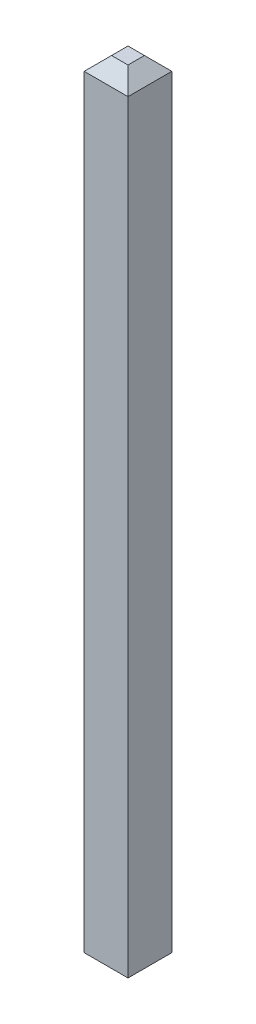
ISO-10303-21;
HEADER;
FILE_DESCRIPTION(('STEP AP214'),'2;1');
FILE_NAME('part.step','',(''),(''),'','','');
FILE_SCHEMA(('AUTOMOTIVE_DESIGN { 1 0 10303 214 1 1 1 1 }'));
ENDSEC;
DATA;
#1=APPLICATION_CONTEXT('core data for automotive mechanical design processes');
#2=APPLICATION_PROTOCOL_DEFINITION('international standard','automotive_design',2000,#1);
#3=PRODUCT_CONTEXT('',#1,'mechanical');
#4=PRODUCT('Part','Part','',(#3));
#5=PRODUCT_RELATED_PRODUCT_CATEGORY('part','',(#4));
#6=PRODUCT_DEFINITION_FORMATION('','',#4);
#7=PRODUCT_DEFINITION_CONTEXT('part definition',#1,'design');
#8=PRODUCT_DEFINITION('design','',#6,#7);
#9=PRODUCT_DEFINITION_SHAPE('','',#8);
#10=(LENGTH_UNIT() NAMED_UNIT(*) SI_UNIT(.MILLI.,.METRE.));
#11=(NAMED_UNIT(*) PLANE_ANGLE_UNIT() SI_UNIT($,.RADIAN.));
#12=(NAMED_UNIT(*) SI_UNIT($,.STERADIAN.) SOLID_ANGLE_UNIT());
#13=UNCERTAINTY_MEASURE_WITH_UNIT(LENGTH_MEASURE(1.E-05),#10,'distance_accuracy_value','');
#14=(GEOMETRIC_REPRESENTATION_CONTEXT(3) GLOBAL_UNCERTAINTY_ASSIGNED_CONTEXT((#13)) GLOBAL_UNIT_ASSIGNED_CONTEXT((#10,
#11,#12)) REPRESENTATION_CONTEXT('',''));
#15=CARTESIAN_POINT('',(0.,0.,0.));
#16=DIRECTION('',(0.,0.,1.));
#17=DIRECTION('',(1.,0.,0.));
#18=AXIS2_PLACEMENT_3D('',#15,#16,#17);
#19=CARTESIAN_POINT('',(6.67,7.07,-0.32));
#20=DIRECTION('',(-0.707106781186548,-0.707106781186548,0.));
#21=DIRECTION('',(-0.707106781186548,0.707106781186548,0.));
#22=AXIS2_PLACEMENT_3D('',#19,#20,#21);
#23=PLANE('',#22);
#24=DIRECTION('',(0.577350269189626,-0.577350269189626,0.577350269189626));
#25=VECTOR('',#24,1.);
#26=CARTESIAN_POINT('',(6.456666666667,7.283333333333,0.106666666667));
#27=LINE('',#26,#25);
#28=CARTESIAN_POINT('',(6.47,7.27,0.12));
#29=VERTEX_POINT('',#28);
#30=CARTESIAN_POINT('',(6.67,7.07,0.32));
#31=VERTEX_POINT('',#30);
#32=EDGE_CURVE('E112',#29,#31,#27,.T.);
#33=ORIENTED_EDGE('',*,*,#32,.T.);
#34=DIRECTION('',(0.,0.,1.));
#35=VECTOR('',#34,1.);
#36=CARTESIAN_POINT('',(6.67,7.07,-0.32));
#37=LINE('',#36,#35);
#38=CARTESIAN_POINT('',(6.67,7.07,-0.32));
#39=VERTEX_POINT('',#38);
#40=EDGE_CURVE('E121',#39,#31,#37,.T.);
#41=ORIENTED_EDGE('',*,*,#40,.F.);
#42=DIRECTION('',(0.577350269189626,-0.577350269189626,-0.577350269189626));
#43=VECTOR('',#42,1.);
#44=CARTESIAN_POINT('',(6.67,7.07,-0.32));
#45=LINE('',#44,#43);
#46=CARTESIAN_POINT('',(6.47,7.27,-0.12));
#47=VERTEX_POINT('',#46);
#48=EDGE_CURVE('E11',#47,#39,#45,.T.);
#49=ORIENTED_EDGE('',*,*,#48,.F.);
#50=DIRECTION('',(0.,0.,-1.));
#51=VECTOR('',#50,1.);
#52=CARTESIAN_POINT('',(6.47,7.27,-0.32));
#53=LINE('',#52,#51);
#54=EDGE_CURVE('E163',#29,#47,#53,.T.);
#55=ORIENTED_EDGE('',*,*,#54,.F.);
#56=EDGE_LOOP('',(#33,#41,#49,#55));
#57=FACE_BOUND('',#56,.T.);
#58=ADVANCED_FACE('F17',(#57),#23,.F.);
#59=CARTESIAN_POINT('',(6.35,7.07,-0.32));
#60=DIRECTION('',(0.,0.707106781186548,-0.707106781186548));
#61=DIRECTION('',(-1.,0.,0.));
#62=AXIS2_PLACEMENT_3D('',#59,#60,#61);
#63=PLANE('',#62);
#64=DIRECTION('',(0.577350269189626,0.577350269189626,0.577350269189626));
#65=VECTOR('',#64,1.);
#66=CARTESIAN_POINT('',(6.163333333333,7.203333333333,-0.186666666667));
#67=LINE('',#66,#65);
#68=CARTESIAN_POINT('',(6.03,7.07,-0.32));
#69=VERTEX_POINT('',#68);
#70=CARTESIAN_POINT('',(6.23,7.27,-0.12));
#71=VERTEX_POINT('',#70);
#72=EDGE_CURVE('E26',#69,#71,#67,.T.);
#73=ORIENTED_EDGE('',*,*,#72,.T.);
#74=DIRECTION('',(-1.,0.,0.));
#75=VECTOR('',#74,1.);
#76=CARTESIAN_POINT('',(6.03,7.27,-0.12));
#77=LINE('',#76,#75);
#78=EDGE_CURVE('E164',#47,#71,#77,.T.);
#79=ORIENTED_EDGE('',*,*,#78,.F.);
#80=ORIENTED_EDGE('',*,*,#48,.T.);
#81=DIRECTION('',(1.,0.,0.));
#82=VECTOR('',#81,1.);
#83=CARTESIAN_POINT('',(6.67,7.07,-0.32));
#84=LINE('',#83,#82);
#85=EDGE_CURVE('E142',#69,#39,#84,.T.);
#86=ORIENTED_EDGE('',*,*,#85,.F.);
#87=EDGE_LOOP('',(#73,#79,#80,#86));
#88=FACE_BOUND('',#87,.T.);
#89=ADVANCED_FACE('F177',(#88),#63,.T.);
#90=CARTESIAN_POINT('',(6.23,7.27,-0.32));
#91=DIRECTION('',(0.707106781186548,-0.707106781186548,0.));
#92=DIRECTION('',(0.,0.,-1.));
#93=AXIS2_PLACEMENT_3D('',#90,#91,#92);
#94=PLANE('',#93);
#95=DIRECTION('',(-0.577350269189626,-0.577350269189626,0.577350269189626));
#96=VECTOR('',#95,1.);
#97=CARTESIAN_POINT('',(6.163333333333,7.203333333333,0.186666666667));
#98=LINE('',#97,#96);
#99=CARTESIAN_POINT('',(6.23,7.27,0.12));
#100=VERTEX_POINT('',#99);
#101=CARTESIAN_POINT('',(6.03,7.07,0.32));
#102=VERTEX_POINT('',#101);
#103=EDGE_CURVE('E39',#100,#102,#98,.T.);
#104=ORIENTED_EDGE('',*,*,#103,.F.);
#105=DIRECTION('',(0.,0.,1.));
#106=VECTOR('',#105,1.);
#107=CARTESIAN_POINT('',(6.23,7.27,-0.32));
#108=LINE('',#107,#106);
#109=EDGE_CURVE('E168',#71,#100,#108,.T.);
#110=ORIENTED_EDGE('',*,*,#109,.F.);
#111=ORIENTED_EDGE('',*,*,#72,.F.);
#112=DIRECTION('',(0.,0.,-1.));
#113=VECTOR('',#112,1.);
#114=CARTESIAN_POINT('',(6.03,7.07,-0.32));
#115=LINE('',#114,#113);
#116=EDGE_CURVE('E124',#102,#69,#115,.T.);
#117=ORIENTED_EDGE('',*,*,#116,.F.);
#118=EDGE_LOOP('',(#104,#110,#111,#117));
#119=FACE_BOUND('',#118,.T.);
#120=ADVANCED_FACE('F125',(#119),#94,.F.);
#121=CARTESIAN_POINT('',(6.03,7.27,0.12));
#122=DIRECTION('',(0.,-0.707106781186548,-0.707106781186548));
#123=DIRECTION('',(0.,-0.707106781186548,0.707106781186548));
#124=AXIS2_PLACEMENT_3D('',#121,#122,#123);
#125=PLANE('',#124);
#126=ORIENTED_EDGE('',*,*,#32,.F.);
#127=DIRECTION('',(1.,0.,0.));
#128=VECTOR('',#127,1.);
#129=CARTESIAN_POINT('',(6.03,7.27,0.12));
#130=LINE('',#129,#128);
#131=EDGE_CURVE('E109',#100,#29,#130,.T.);
#132=ORIENTED_EDGE('',*,*,#131,.F.);
#133=ORIENTED_EDGE('',*,*,#103,.T.);
#134=DIRECTION('',(-1.,0.,0.));
#135=VECTOR('',#134,1.);
#136=CARTESIAN_POINT('',(6.35,7.07,0.32));
#137=LINE('',#136,#135);
#138=EDGE_CURVE('E106',#31,#102,#137,.T.);
#139=ORIENTED_EDGE('',*,*,#138,.F.);
#140=EDGE_LOOP('',(#126,#132,#133,#139));
#141=FACE_BOUND('',#140,.T.);
#142=ADVANCED_FACE('F105',(#141),#125,.F.);
#143=CARTESIAN_POINT('',(6.03,7.27,-0.32));
#144=DIRECTION('',(0.,-1.,0.));
#145=DIRECTION('',(0.,0.,-1.));
#146=AXIS2_PLACEMENT_3D('',#143,#144,#145);
#147=PLANE('',#146);
#148=ORIENTED_EDGE('',*,*,#54,.T.);
#149=ORIENTED_EDGE('',*,*,#78,.T.);
#150=ORIENTED_EDGE('',*,*,#109,.T.);
#151=ORIENTED_EDGE('',*,*,#131,.T.);
#152=EDGE_LOOP('',(#148,#149,#150,#151));
#153=FACE_BOUND('',#152,.T.);
#154=ADVANCED_FACE('F182',(#153),#147,.F.);
#155=CARTESIAN_POINT('',(6.67,7.27,-0.32));
#156=DIRECTION('',(-1.,0.,0.));
#157=DIRECTION('',(0.,1.,0.));
#158=AXIS2_PLACEMENT_3D('',#155,#156,#157);
#159=PLANE('',#158);
#160=DIRECTION('',(0.,-1.,0.));
#161=VECTOR('',#160,1.);
#162=CARTESIAN_POINT('',(6.67,7.27,-0.32));
#163=LINE('',#162,#161);
#164=CARTESIAN_POINT('',(6.67,-4.07,-0.32));
#165=VERTEX_POINT('',#164);
#166=EDGE_CURVE('E135',#39,#165,#163,.T.);
#167=ORIENTED_EDGE('',*,*,#166,.F.);
#168=ORIENTED_EDGE('',*,*,#40,.T.);
#169=DIRECTION('',(0.,-1.,0.));
#170=VECTOR('',#169,1.);
#171=CARTESIAN_POINT('',(6.67,7.27,0.32));
#172=LINE('',#171,#170);
#173=CARTESIAN_POINT('',(6.67,-4.07,0.32));
#174=VERTEX_POINT('',#173);
#175=EDGE_CURVE('E119',#31,#174,#172,.T.);
#176=ORIENTED_EDGE('',*,*,#175,.T.);
#177=DIRECTION('',(0.,0.,-1.));
#178=VECTOR('',#177,1.);
#179=CARTESIAN_POINT('',(6.67,-4.07,-0.32));
#180=LINE('',#179,#178);
#181=EDGE_CURVE('E157',#174,#165,#180,.T.);
#182=ORIENTED_EDGE('',*,*,#181,.T.);
#183=EDGE_LOOP('',(#167,#168,#176,#182));
#184=FACE_BOUND('',#183,.T.);
#185=ADVANCED_FACE('F310',(#184),#159,.F.);
#186=CARTESIAN_POINT('',(6.35,1.5,0.32));
#187=DIRECTION('',(0.,0.,-1.));
#188=DIRECTION('',(0.,-1.,0.));
#189=AXIS2_PLACEMENT_3D('',#186,#187,#188);
#190=PLANE('',#189);
#191=ORIENTED_EDGE('',*,*,#175,.F.);
#192=ORIENTED_EDGE('',*,*,#138,.T.);
#193=DIRECTION('',(0.,1.,0.));
#194=VECTOR('',#193,1.);
#195=CARTESIAN_POINT('',(6.03,-4.27,0.32));
#196=LINE('',#195,#194);
#197=CARTESIAN_POINT('',(6.03,-4.07,0.32));
#198=VERTEX_POINT('',#197);
#199=EDGE_CURVE('E118',#198,#102,#196,.T.);
#200=ORIENTED_EDGE('',*,*,#199,.F.);
#201=DIRECTION('',(1.,0.,0.));
#202=VECTOR('',#201,1.);
#203=CARTESIAN_POINT('',(6.35,-4.07,0.32));
#204=LINE('',#203,#202);
#205=EDGE_CURVE('E98',#198,#174,#204,.T.);
#206=ORIENTED_EDGE('',*,*,#205,.T.);
#207=EDGE_LOOP('',(#191,#192,#200,#206));
#208=FACE_BOUND('',#207,.T.);
#209=ADVANCED_FACE('F116',(#208),#190,.F.);
#210=CARTESIAN_POINT('',(6.47,-4.27,-0.32));
#211=DIRECTION('',(-0.707106781186548,0.707106781186548,0.));
#212=DIRECTION('',(0.,0.,1.));
#213=AXIS2_PLACEMENT_3D('',#210,#211,#212);
#214=PLANE('',#213);
#215=DIRECTION('',(-0.577350269189626,-0.577350269189626,0.577350269189626));
#216=VECTOR('',#215,1.);
#217=CARTESIAN_POINT('',(6.536666666667,-4.203333333333,-0.186666666667));
#218=LINE('',#217,#216);
#219=CARTESIAN_POINT('',(6.47,-4.27,-0.12));
#220=VERTEX_POINT('',#219);
#221=EDGE_CURVE('E148',#165,#220,#218,.T.);
#222=ORIENTED_EDGE('',*,*,#221,.F.);
#223=ORIENTED_EDGE('',*,*,#181,.F.);
#224=DIRECTION('',(-0.577350269189626,-0.577350269189626,-0.577350269189626));
#225=VECTOR('',#224,1.);
#226=CARTESIAN_POINT('',(6.323333333333,-4.416666666667,-0.02666666666667));
#227=LINE('',#226,#225);
#228=CARTESIAN_POINT('',(6.47,-4.27,0.12));
#229=VERTEX_POINT('',#228);
#230=EDGE_CURVE('E156',#174,#229,#227,.T.);
#231=ORIENTED_EDGE('',*,*,#230,.T.);
#232=DIRECTION('',(0.,0.,1.));
#233=VECTOR('',#232,1.);
#234=CARTESIAN_POINT('',(6.47,-4.27,-0.32));
#235=LINE('',#234,#233);
#236=EDGE_CURVE('E551',#220,#229,#235,.T.);
#237=ORIENTED_EDGE('',*,*,#236,.F.);
#238=EDGE_LOOP('',(#222,#223,#231,#237));
#239=FACE_BOUND('',#238,.T.);
#240=ADVANCED_FACE('F270',(#239),#214,.F.);
#241=CARTESIAN_POINT('',(6.67,-4.27,0.12));
#242=DIRECTION('',(0.,0.707106781186548,-0.707106781186548));
#243=DIRECTION('',(-1.,0.,0.));
#244=AXIS2_PLACEMENT_3D('',#241,#242,#243);
#245=PLANE('',#244);
#246=ORIENTED_EDGE('',*,*,#230,.F.);
#247=ORIENTED_EDGE('',*,*,#205,.F.);
#248=DIRECTION('',(-0.577350269189626,0.577350269189626,0.577350269189626));
#249=VECTOR('',#248,1.);
#250=CARTESIAN_POINT('',(6.243333333333,-4.283333333333,0.106666666667));
#251=LINE('',#250,#249);
#252=CARTESIAN_POINT('',(6.23,-4.27,0.12));
#253=VERTEX_POINT('',#252);
#254=EDGE_CURVE('E153',#253,#198,#251,.T.);
#255=ORIENTED_EDGE('',*,*,#254,.F.);
#256=DIRECTION('',(-1.,0.,0.));
#257=VECTOR('',#256,1.);
#258=CARTESIAN_POINT('',(6.67,-4.27,0.12));
#259=LINE('',#258,#257);
#260=EDGE_CURVE('E197',#229,#253,#259,.T.);
#261=ORIENTED_EDGE('',*,*,#260,.F.);
#262=EDGE_LOOP('',(#246,#247,#255,#261));
#263=FACE_BOUND('',#262,.T.);
#264=ADVANCED_FACE('F265',(#263),#245,.F.);
#265=CARTESIAN_POINT('',(6.03,-4.07,-0.32));
#266=DIRECTION('',(0.707106781186548,0.707106781186548,0.));
#267=DIRECTION('',(0.,0.,-1.));
#268=AXIS2_PLACEMENT_3D('',#265,#266,#267);
#269=PLANE('',#268);
#270=DIRECTION('',(0.577350269189626,-0.577350269189626,0.577350269189626));
#271=VECTOR('',#270,1.);
#272=CARTESIAN_POINT('',(6.136666666667,-4.176666666667,-0.213333333333));
#273=LINE('',#272,#271);
#274=CARTESIAN_POINT('',(6.03,-4.07,-0.32));
#275=VERTEX_POINT('',#274);
#276=CARTESIAN_POINT('',(6.23,-4.27,-0.12));
#277=VERTEX_POINT('',#276);
#278=EDGE_CURVE('E146',#275,#277,#273,.T.);
#279=ORIENTED_EDGE('',*,*,#278,.T.);
#280=DIRECTION('',(0.,0.,-1.));
#281=VECTOR('',#280,1.);
#282=CARTESIAN_POINT('',(6.23,-4.27,-0.32));
#283=LINE('',#282,#281);
#284=EDGE_CURVE('E192',#253,#277,#283,.T.);
#285=ORIENTED_EDGE('',*,*,#284,.F.);
#286=ORIENTED_EDGE('',*,*,#254,.T.);
#287=DIRECTION('',(0.,0.,1.));
#288=VECTOR('',#287,1.);
#289=CARTESIAN_POINT('',(6.03,-4.07,-0.32));
#290=LINE('',#289,#288);
#291=EDGE_CURVE('E130',#275,#198,#290,.T.);
#292=ORIENTED_EDGE('',*,*,#291,.F.);
#293=EDGE_LOOP('',(#279,#285,#286,#292));
#294=FACE_BOUND('',#293,.T.);
#295=ADVANCED_FACE('F269',(#294),#269,.F.);
#296=CARTESIAN_POINT('',(6.03,-4.27,-0.32));
#297=DIRECTION('',(1.,0.,0.));
#298=DIRECTION('',(0.,0.,1.));
#299=AXIS2_PLACEMENT_3D('',#296,#297,#298);
#300=PLANE('',#299);
#301=ORIENTED_EDGE('',*,*,#199,.T.);
#302=ORIENTED_EDGE('',*,*,#116,.T.);
#303=DIRECTION('',(0.,1.,0.));
#304=VECTOR('',#303,1.);
#305=CARTESIAN_POINT('',(6.03,-4.27,-0.32));
#306=LINE('',#305,#304);
#307=EDGE_CURVE('E150',#275,#69,#306,.T.);
#308=ORIENTED_EDGE('',*,*,#307,.F.);
#309=ORIENTED_EDGE('',*,*,#291,.T.);
#310=EDGE_LOOP('',(#301,#302,#308,#309));
#311=FACE_BOUND('',#310,.T.);
#312=ADVANCED_FACE('F133',(#311),#300,.F.);
#313=CARTESIAN_POINT('',(6.35,1.5,-0.32));
#314=DIRECTION('',(0.,0.,-1.));
#315=DIRECTION('',(0.,-1.,0.));
#316=AXIS2_PLACEMENT_3D('',#313,#314,#315);
#317=PLANE('',#316);
#318=ORIENTED_EDGE('',*,*,#307,.T.);
#319=ORIENTED_EDGE('',*,*,#85,.T.);
#320=ORIENTED_EDGE('',*,*,#166,.T.);
#321=DIRECTION('',(-1.,0.,0.));
#322=VECTOR('',#321,1.);
#323=CARTESIAN_POINT('',(6.03,-4.07,-0.32));
#324=LINE('',#323,#322);
#325=EDGE_CURVE('E151',#165,#275,#324,.T.);
#326=ORIENTED_EDGE('',*,*,#325,.T.);
#327=EDGE_LOOP('',(#318,#319,#320,#326));
#328=FACE_BOUND('',#327,.T.);
#329=ADVANCED_FACE('F278',(#328),#317,.T.);
#330=CARTESIAN_POINT('',(6.35,-4.07,-0.32));
#331=DIRECTION('',(0.,-0.707106781186548,-0.707106781186548));
#332=DIRECTION('',(0.,-0.707106781186548,0.707106781186548));
#333=AXIS2_PLACEMENT_3D('',#330,#331,#332);
#334=PLANE('',#333);
#335=ORIENTED_EDGE('',*,*,#278,.F.);
#336=ORIENTED_EDGE('',*,*,#325,.F.);
#337=ORIENTED_EDGE('',*,*,#221,.T.);
#338=DIRECTION('',(1.,0.,0.));
#339=VECTOR('',#338,1.);
#340=CARTESIAN_POINT('',(6.67,-4.27,-0.12));
#341=LINE('',#340,#339);
#342=EDGE_CURVE('E196',#277,#220,#341,.T.);
#343=ORIENTED_EDGE('',*,*,#342,.F.);
#344=EDGE_LOOP('',(#335,#336,#337,#343));
#345=FACE_BOUND('',#344,.T.);
#346=ADVANCED_FACE('F258',(#345),#334,.T.);
#347=CARTESIAN_POINT('',(6.67,-4.27,-0.32));
#348=DIRECTION('',(0.,1.,0.));
#349=DIRECTION('',(0.,0.,-1.));
#350=AXIS2_PLACEMENT_3D('',#347,#348,#349);
#351=PLANE('',#350);
#352=ORIENTED_EDGE('',*,*,#236,.T.);
#353=ORIENTED_EDGE('',*,*,#260,.T.);
#354=ORIENTED_EDGE('',*,*,#284,.T.);
#355=ORIENTED_EDGE('',*,*,#342,.T.);
#356=EDGE_LOOP('',(#352,#353,#354,#355));
#357=FACE_BOUND('',#356,.T.);
#358=ADVANCED_FACE('F253',(#357),#351,.F.);
#359=CLOSED_SHELL('',(#58,#89,#120,#142,#154,#185,#209,#240,#264,#295,#312,#329,#346,#358));
#360=MANIFOLD_SOLID_BREP('B1',#359);
#361=ADVANCED_BREP_SHAPE_REPRESENTATION('',(#18,#360),#14);
#362=SHAPE_DEFINITION_REPRESENTATION(#9,#361);
ENDSEC;
END-ISO-10303-21;
